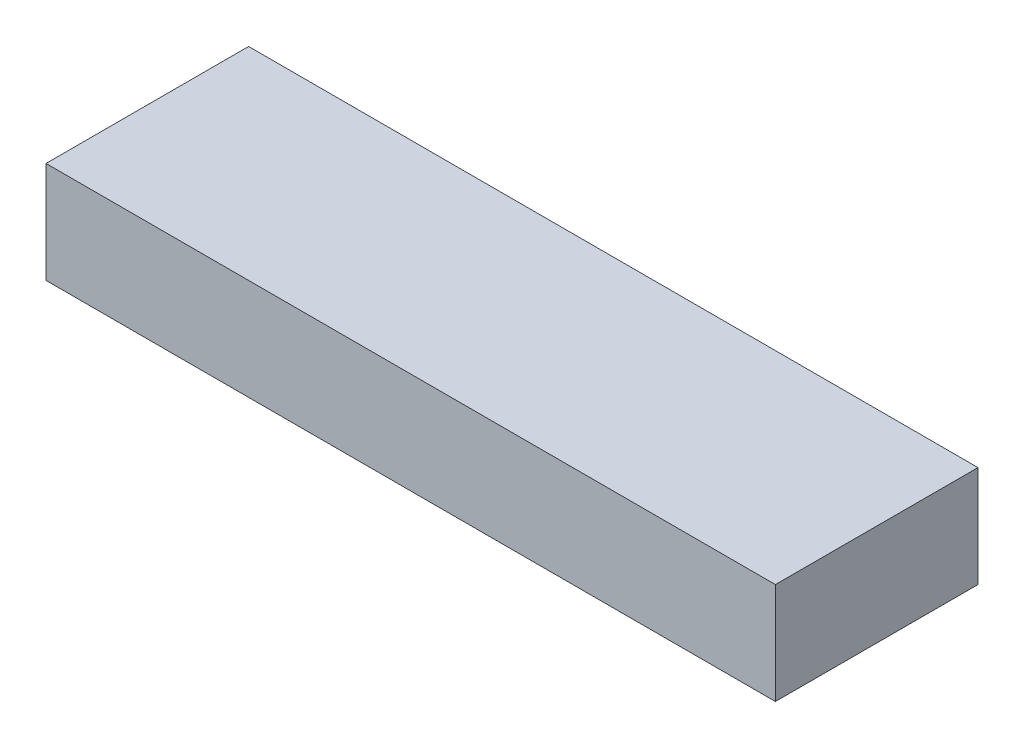
ISO-10303-21;
HEADER;
FILE_DESCRIPTION(('STEP AP214'),'2;1');
FILE_NAME('part.step','',(''),(''),'','','');
FILE_SCHEMA(('AUTOMOTIVE_DESIGN { 1 0 10303 214 1 1 1 1 }'));
ENDSEC;
DATA;
#1=APPLICATION_CONTEXT('core data for automotive mechanical design processes');
#2=APPLICATION_PROTOCOL_DEFINITION('international standard','automotive_design',2000,#1);
#3=PRODUCT_CONTEXT('',#1,'mechanical');
#4=PRODUCT('Part','Part','',(#3));
#5=PRODUCT_RELATED_PRODUCT_CATEGORY('part','',(#4));
#6=PRODUCT_DEFINITION_FORMATION('','',#4);
#7=PRODUCT_DEFINITION_CONTEXT('part definition',#1,'design');
#8=PRODUCT_DEFINITION('design','',#6,#7);
#9=PRODUCT_DEFINITION_SHAPE('','',#8);
#10=(LENGTH_UNIT() NAMED_UNIT(*) SI_UNIT(.MILLI.,.METRE.));
#11=(NAMED_UNIT(*) PLANE_ANGLE_UNIT() SI_UNIT($,.RADIAN.));
#12=(NAMED_UNIT(*) SI_UNIT($,.STERADIAN.) SOLID_ANGLE_UNIT());
#13=UNCERTAINTY_MEASURE_WITH_UNIT(LENGTH_MEASURE(1.E-05),#10,'distance_accuracy_value','');
#14=(GEOMETRIC_REPRESENTATION_CONTEXT(3) GLOBAL_UNCERTAINTY_ASSIGNED_CONTEXT((#13)) GLOBAL_UNIT_ASSIGNED_CONTEXT((#10,
#11,#12)) REPRESENTATION_CONTEXT('',''));
#15=CARTESIAN_POINT('',(0.,0.,0.));
#16=DIRECTION('',(0.,0.,1.));
#17=DIRECTION('',(1.,0.,0.));
#18=AXIS2_PLACEMENT_3D('',#15,#16,#17);
#19=CARTESIAN_POINT('',(90.,25.,-25.));
#20=DIRECTION('',(-1.,0.,0.));
#21=DIRECTION('',(0.,0.,1.));
#22=AXIS2_PLACEMENT_3D('',#19,#20,#21);
#23=PLANE('',#22);
#24=DIRECTION('',(0.,0.,-1.));
#25=VECTOR('',#24,1.);
#26=CARTESIAN_POINT('',(90.,0.,-25.));
#27=LINE('',#26,#25);
#28=CARTESIAN_POINT('',(90.,0.,25.));
#29=VERTEX_POINT('',#28);
#30=CARTESIAN_POINT('',(90.,0.,-25.));
#31=VERTEX_POINT('',#30);
#32=EDGE_CURVE('E96',#29,#31,#27,.T.);
#33=ORIENTED_EDGE('',*,*,#32,.T.);
#34=DIRECTION('',(0.,-1.,0.));
#35=VECTOR('',#34,1.);
#36=CARTESIAN_POINT('',(90.,25.,-25.));
#37=LINE('',#36,#35);
#38=CARTESIAN_POINT('',(90.,25.,-25.));
#39=VERTEX_POINT('',#38);
#40=EDGE_CURVE('E11',#39,#31,#37,.T.);
#41=ORIENTED_EDGE('',*,*,#40,.F.);
#42=DIRECTION('',(0.,0.,-1.));
#43=VECTOR('',#42,1.);
#44=CARTESIAN_POINT('',(90.,25.,-25.));
#45=LINE('',#44,#43);
#46=CARTESIAN_POINT('',(90.,25.,25.));
#47=VERTEX_POINT('',#46);
#48=EDGE_CURVE('E84',#47,#39,#45,.T.);
#49=ORIENTED_EDGE('',*,*,#48,.F.);
#50=DIRECTION('',(0.,-1.,0.));
#51=VECTOR('',#50,1.);
#52=CARTESIAN_POINT('',(90.,25.,25.));
#53=LINE('',#52,#51);
#54=EDGE_CURVE('E92',#47,#29,#53,.T.);
#55=ORIENTED_EDGE('',*,*,#54,.T.);
#56=EDGE_LOOP('',(#33,#41,#49,#55));
#57=FACE_BOUND('',#56,.T.);
#58=ADVANCED_FACE('F33',(#57),#23,.F.);
#59=CARTESIAN_POINT('',(-90.,25.,-25.));
#60=DIRECTION('',(0.,0.,1.));
#61=DIRECTION('',(1.,0.,0.));
#62=AXIS2_PLACEMENT_3D('',#59,#60,#61);
#63=PLANE('',#62);
#64=DIRECTION('',(-1.,0.,0.));
#65=VECTOR('',#64,1.);
#66=CARTESIAN_POINT('',(-90.,0.,-25.));
#67=LINE('',#66,#65);
#68=CARTESIAN_POINT('',(-90.,0.,-25.));
#69=VERTEX_POINT('',#68);
#70=EDGE_CURVE('E88',#31,#69,#67,.T.);
#71=ORIENTED_EDGE('',*,*,#70,.T.);
#72=DIRECTION('',(0.,-1.,0.));
#73=VECTOR('',#72,1.);
#74=CARTESIAN_POINT('',(-90.,25.,-25.));
#75=LINE('',#74,#73);
#76=CARTESIAN_POINT('',(-90.,25.,-25.));
#77=VERTEX_POINT('',#76);
#78=EDGE_CURVE('E41',#77,#69,#75,.T.);
#79=ORIENTED_EDGE('',*,*,#78,.F.);
#80=DIRECTION('',(-1.,0.,0.));
#81=VECTOR('',#80,1.);
#82=CARTESIAN_POINT('',(-90.,25.,-25.));
#83=LINE('',#82,#81);
#84=EDGE_CURVE('E79',#39,#77,#83,.T.);
#85=ORIENTED_EDGE('',*,*,#84,.F.);
#86=ORIENTED_EDGE('',*,*,#40,.T.);
#87=EDGE_LOOP('',(#71,#79,#85,#86));
#88=FACE_BOUND('',#87,.T.);
#89=ADVANCED_FACE('F87',(#88),#63,.F.);
#90=CARTESIAN_POINT('',(-90.,25.,-25.));
#91=DIRECTION('',(1.,0.,0.));
#92=DIRECTION('',(0.,0.,-1.));
#93=AXIS2_PLACEMENT_3D('',#90,#91,#92);
#94=PLANE('',#93);
#95=DIRECTION('',(0.,0.,1.));
#96=VECTOR('',#95,1.);
#97=CARTESIAN_POINT('',(-90.,0.,-25.));
#98=LINE('',#97,#96);
#99=CARTESIAN_POINT('',(-90.,0.,25.));
#100=VERTEX_POINT('',#99);
#101=EDGE_CURVE('E66',#69,#100,#98,.T.);
#102=ORIENTED_EDGE('',*,*,#101,.T.);
#103=DIRECTION('',(0.,-1.,0.));
#104=VECTOR('',#103,1.);
#105=CARTESIAN_POINT('',(-90.,25.,25.));
#106=LINE('',#105,#104);
#107=CARTESIAN_POINT('',(-90.,25.,25.));
#108=VERTEX_POINT('',#107);
#109=EDGE_CURVE('E89',#108,#100,#106,.T.);
#110=ORIENTED_EDGE('',*,*,#109,.F.);
#111=DIRECTION('',(0.,0.,1.));
#112=VECTOR('',#111,1.);
#113=CARTESIAN_POINT('',(-90.,25.,-25.));
#114=LINE('',#113,#112);
#115=EDGE_CURVE('E82',#77,#108,#114,.T.);
#116=ORIENTED_EDGE('',*,*,#115,.F.);
#117=ORIENTED_EDGE('',*,*,#78,.T.);
#118=EDGE_LOOP('',(#102,#110,#116,#117));
#119=FACE_BOUND('',#118,.T.);
#120=ADVANCED_FACE('F90',(#119),#94,.F.);
#121=CARTESIAN_POINT('',(-90.,25.,25.));
#122=DIRECTION('',(0.,0.,-1.));
#123=DIRECTION('',(-1.,0.,0.));
#124=AXIS2_PLACEMENT_3D('',#121,#122,#123);
#125=PLANE('',#124);
#126=DIRECTION('',(1.,0.,0.));
#127=VECTOR('',#126,1.);
#128=CARTESIAN_POINT('',(-90.,0.,25.));
#129=LINE('',#128,#127);
#130=EDGE_CURVE('E72',#100,#29,#129,.T.);
#131=ORIENTED_EDGE('',*,*,#130,.T.);
#132=ORIENTED_EDGE('',*,*,#54,.F.);
#133=DIRECTION('',(1.,0.,0.));
#134=VECTOR('',#133,1.);
#135=CARTESIAN_POINT('',(-90.,25.,25.));
#136=LINE('',#135,#134);
#137=EDGE_CURVE('E49',#108,#47,#136,.T.);
#138=ORIENTED_EDGE('',*,*,#137,.F.);
#139=ORIENTED_EDGE('',*,*,#109,.T.);
#140=EDGE_LOOP('',(#131,#132,#138,#139));
#141=FACE_BOUND('',#140,.T.);
#142=ADVANCED_FACE('F103',(#141),#125,.F.);
#143=CARTESIAN_POINT('',(0.,25.,0.));
#144=DIRECTION('',(0.,1.,0.));
#145=DIRECTION('',(0.,0.,1.));
#146=AXIS2_PLACEMENT_3D('',#143,#144,#145);
#147=PLANE('',#146);
#148=ORIENTED_EDGE('',*,*,#48,.T.);
#149=ORIENTED_EDGE('',*,*,#84,.T.);
#150=ORIENTED_EDGE('',*,*,#115,.T.);
#151=ORIENTED_EDGE('',*,*,#137,.T.);
#152=EDGE_LOOP('',(#148,#149,#150,#151));
#153=FACE_BOUND('',#152,.T.);
#154=ADVANCED_FACE('F80',(#153),#147,.T.);
#155=CARTESIAN_POINT('',(0.,0.,0.));
#156=DIRECTION('',(0.,1.,0.));
#157=DIRECTION('',(0.,0.,1.));
#158=AXIS2_PLACEMENT_3D('',#155,#156,#157);
#159=PLANE('',#158);
#160=ORIENTED_EDGE('',*,*,#32,.F.);
#161=ORIENTED_EDGE('',*,*,#130,.F.);
#162=ORIENTED_EDGE('',*,*,#101,.F.);
#163=ORIENTED_EDGE('',*,*,#70,.F.);
#164=EDGE_LOOP('',(#160,#161,#162,#163));
#165=FACE_BOUND('',#164,.T.);
#166=ADVANCED_FACE('F106',(#165),#159,.F.);
#167=CLOSED_SHELL('',(#58,#89,#120,#142,#154,#166));
#168=MANIFOLD_SOLID_BREP('B2',#167);
#169=ADVANCED_BREP_SHAPE_REPRESENTATION('',(#18,#168),#14);
#170=SHAPE_DEFINITION_REPRESENTATION(#9,#169);
ENDSEC;
END-ISO-10303-21;
